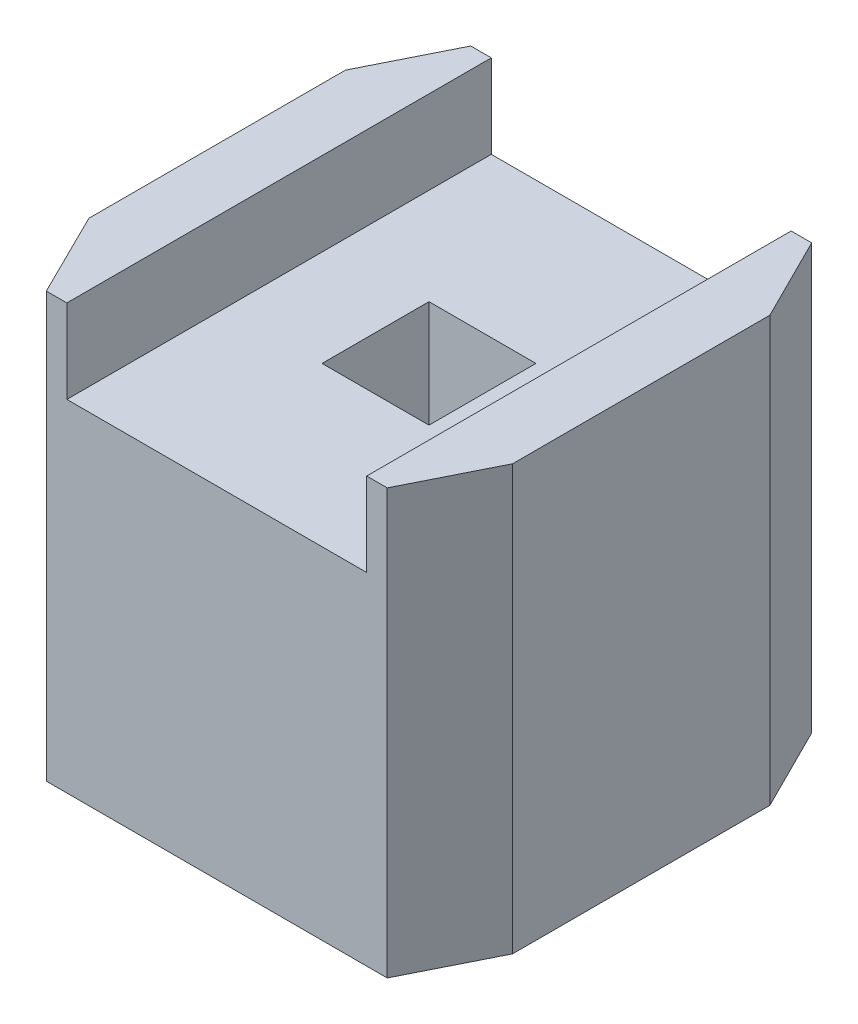
ISO-10303-21;
HEADER;
FILE_DESCRIPTION(('STEP AP214'),'2;1');
FILE_NAME('part.step','',(''),(''),'','','');
FILE_SCHEMA(('AUTOMOTIVE_DESIGN { 1 0 10303 214 1 1 1 1 }'));
ENDSEC;
DATA;
#1=APPLICATION_CONTEXT('core data for automotive mechanical design processes');
#2=APPLICATION_PROTOCOL_DEFINITION('international standard','automotive_design',2000,#1);
#3=PRODUCT_CONTEXT('',#1,'mechanical');
#4=PRODUCT('Part','Part','',(#3));
#5=PRODUCT_RELATED_PRODUCT_CATEGORY('part','',(#4));
#6=PRODUCT_DEFINITION_FORMATION('','',#4);
#7=PRODUCT_DEFINITION_CONTEXT('part definition',#1,'design');
#8=PRODUCT_DEFINITION('design','',#6,#7);
#9=PRODUCT_DEFINITION_SHAPE('','',#8);
#10=(LENGTH_UNIT() NAMED_UNIT(*) SI_UNIT(.MILLI.,.METRE.));
#11=(NAMED_UNIT(*) PLANE_ANGLE_UNIT() SI_UNIT($,.RADIAN.));
#12=(NAMED_UNIT(*) SI_UNIT($,.STERADIAN.) SOLID_ANGLE_UNIT());
#13=UNCERTAINTY_MEASURE_WITH_UNIT(LENGTH_MEASURE(1.E-05),#10,'distance_accuracy_value','');
#14=(GEOMETRIC_REPRESENTATION_CONTEXT(3) GLOBAL_UNCERTAINTY_ASSIGNED_CONTEXT((#13)) GLOBAL_UNIT_ASSIGNED_CONTEXT((#10,
#11,#12)) REPRESENTATION_CONTEXT('',''));
#15=CARTESIAN_POINT('',(0.,0.,0.));
#16=DIRECTION('',(0.,0.,1.));
#17=DIRECTION('',(1.,0.,0.));
#18=AXIS2_PLACEMENT_3D('',#15,#16,#17);
#19=CARTESIAN_POINT('',(0.,2.54,0.));
#20=DIRECTION('',(0.,1.,0.));
#21=DIRECTION('',(0.,0.,1.));
#22=AXIS2_PLACEMENT_3D('',#19,#20,#21);
#23=PLANE('',#22);
#24=DIRECTION('',(0.,0.,1.));
#25=VECTOR('',#24,1.);
#26=CARTESIAN_POINT('',(-0.897144765117483,2.54,1.27));
#27=LINE('',#26,#25);
#28=CARTESIAN_POINT('',(-0.897144765117483,2.54,-1.27));
#29=VERTEX_POINT('',#28);
#30=CARTESIAN_POINT('',(-0.897144765117483,2.54,1.27));
#31=VERTEX_POINT('',#30);
#32=EDGE_CURVE('E284',#29,#31,#27,.T.);
#33=ORIENTED_EDGE('',*,*,#32,.F.);
#34=DIRECTION('',(-1.,0.,0.));
#35=VECTOR('',#34,1.);
#36=CARTESIAN_POINT('',(1.02,2.54,-1.27));
#37=LINE('',#36,#35);
#38=CARTESIAN_POINT('',(-1.02,2.54,-1.27));
#39=VERTEX_POINT('',#38);
#40=EDGE_CURVE('E203',#29,#39,#37,.T.);
#41=ORIENTED_EDGE('',*,*,#40,.T.);
#42=DIRECTION('',(-0.447213595499961,0.,0.894427190999915));
#43=VECTOR('',#42,1.);
#44=CARTESIAN_POINT('',(-1.02,2.54,-1.27));
#45=LINE('',#44,#43);
#46=CARTESIAN_POINT('',(-1.27,2.54,-0.770000000000002));
#47=VERTEX_POINT('',#46);
#48=EDGE_CURVE('E202',#39,#47,#45,.T.);
#49=ORIENTED_EDGE('',*,*,#48,.T.);
#50=DIRECTION('',(0.,0.,1.));
#51=VECTOR('',#50,1.);
#52=CARTESIAN_POINT('',(-1.27,2.54,-0.770000000000002));
#53=LINE('',#52,#51);
#54=CARTESIAN_POINT('',(-1.27,2.54,0.765040333073111));
#55=VERTEX_POINT('',#54);
#56=EDGE_CURVE('E205',#47,#55,#53,.T.);
#57=ORIENTED_EDGE('',*,*,#56,.T.);
#58=DIRECTION('',(0.443689249098496,0.,0.896180701775268));
#59=VECTOR('',#58,1.);
#60=CARTESIAN_POINT('',(-1.27,2.54,0.765040333073111));
#61=LINE('',#60,#59);
#62=CARTESIAN_POINT('',(-1.02,2.54,1.27));
#63=VERTEX_POINT('',#62);
#64=EDGE_CURVE('E207',#55,#63,#61,.T.);
#65=ORIENTED_EDGE('',*,*,#64,.T.);
#66=DIRECTION('',(1.,0.,0.));
#67=VECTOR('',#66,1.);
#68=CARTESIAN_POINT('',(-1.02,2.54,1.27));
#69=LINE('',#68,#67);
#70=EDGE_CURVE('E209',#63,#31,#69,.T.);
#71=ORIENTED_EDGE('',*,*,#70,.T.);
#72=EDGE_LOOP('',(#33,#41,#49,#57,#65,#71));
#73=FACE_BOUND('',#72,.T.);
#74=ADVANCED_FACE('F32',(#73),#23,.T.);
#75=CARTESIAN_POINT('',(-0.32,2.54,0.32));
#76=DIRECTION('',(1.,0.,0.));
#77=DIRECTION('',(0.,0.,-1.));
#78=AXIS2_PLACEMENT_3D('',#75,#76,#77);
#79=PLANE('',#78);
#80=DIRECTION('',(0.,-1.,0.));
#81=VECTOR('',#80,1.);
#82=CARTESIAN_POINT('',(-0.32,2.54,-0.32));
#83=LINE('',#82,#81);
#84=CARTESIAN_POINT('',(-0.32,2.04,-0.32));
#85=VERTEX_POINT('',#84);
#86=CARTESIAN_POINT('',(-0.32,0.,-0.32));
#87=VERTEX_POINT('',#86);
#88=EDGE_CURVE('E190',#85,#87,#83,.T.);
#89=ORIENTED_EDGE('',*,*,#88,.F.);
#90=DIRECTION('',(0.,0.,1.));
#91=VECTOR('',#90,1.);
#92=CARTESIAN_POINT('',(-0.32,2.04,0.32));
#93=LINE('',#92,#91);
#94=CARTESIAN_POINT('',(-0.32,2.04,0.32));
#95=VERTEX_POINT('',#94);
#96=EDGE_CURVE('E55',#85,#95,#93,.T.);
#97=ORIENTED_EDGE('',*,*,#96,.T.);
#98=DIRECTION('',(0.,-1.,0.));
#99=VECTOR('',#98,1.);
#100=CARTESIAN_POINT('',(-0.32,2.54,0.32));
#101=LINE('',#100,#99);
#102=CARTESIAN_POINT('',(-0.32,0.,0.32));
#103=VERTEX_POINT('',#102);
#104=EDGE_CURVE('E196',#95,#103,#101,.T.);
#105=ORIENTED_EDGE('',*,*,#104,.T.);
#106=DIRECTION('',(0.,0.,1.));
#107=VECTOR('',#106,1.);
#108=CARTESIAN_POINT('',(-0.32,0.,0.32));
#109=LINE('',#108,#107);
#110=EDGE_CURVE('E178',#87,#103,#109,.T.);
#111=ORIENTED_EDGE('',*,*,#110,.F.);
#112=EDGE_LOOP('',(#89,#97,#105,#111));
#113=FACE_BOUND('',#112,.T.);
#114=ADVANCED_FACE('F317',(#113),#79,.T.);
#115=CARTESIAN_POINT('',(0.32,2.54,0.32));
#116=DIRECTION('',(0.,0.,-1.));
#117=DIRECTION('',(-1.,0.,0.));
#118=AXIS2_PLACEMENT_3D('',#115,#116,#117);
#119=PLANE('',#118);
#120=ORIENTED_EDGE('',*,*,#104,.F.);
#121=DIRECTION('',(1.,0.,0.));
#122=VECTOR('',#121,1.);
#123=CARTESIAN_POINT('',(0.32,2.04,0.32));
#124=LINE('',#123,#122);
#125=CARTESIAN_POINT('',(0.32,2.04,0.32));
#126=VERTEX_POINT('',#125);
#127=EDGE_CURVE('E174',#95,#126,#124,.T.);
#128=ORIENTED_EDGE('',*,*,#127,.T.);
#129=DIRECTION('',(0.,-1.,0.));
#130=VECTOR('',#129,1.);
#131=CARTESIAN_POINT('',(0.32,2.54,0.32));
#132=LINE('',#131,#130);
#133=CARTESIAN_POINT('',(0.32,0.,0.32));
#134=VERTEX_POINT('',#133);
#135=EDGE_CURVE('E194',#126,#134,#132,.T.);
#136=ORIENTED_EDGE('',*,*,#135,.T.);
#137=DIRECTION('',(1.,0.,0.));
#138=VECTOR('',#137,1.);
#139=CARTESIAN_POINT('',(0.32,0.,0.32));
#140=LINE('',#139,#138);
#141=EDGE_CURVE('E181',#103,#134,#140,.T.);
#142=ORIENTED_EDGE('',*,*,#141,.F.);
#143=EDGE_LOOP('',(#120,#128,#136,#142));
#144=FACE_BOUND('',#143,.T.);
#145=ADVANCED_FACE('F322',(#144),#119,.T.);
#146=CARTESIAN_POINT('',(0.32,2.54,0.32));
#147=DIRECTION('',(-1.,0.,0.));
#148=DIRECTION('',(0.,0.,1.));
#149=AXIS2_PLACEMENT_3D('',#146,#147,#148);
#150=PLANE('',#149);
#151=ORIENTED_EDGE('',*,*,#135,.F.);
#152=DIRECTION('',(0.,0.,-1.));
#153=VECTOR('',#152,1.);
#154=CARTESIAN_POINT('',(0.32,2.04,0.32));
#155=LINE('',#154,#153);
#156=CARTESIAN_POINT('',(0.32,2.04,-0.32));
#157=VERTEX_POINT('',#156);
#158=EDGE_CURVE('E171',#126,#157,#155,.T.);
#159=ORIENTED_EDGE('',*,*,#158,.T.);
#160=DIRECTION('',(0.,-1.,0.));
#161=VECTOR('',#160,1.);
#162=CARTESIAN_POINT('',(0.32,2.54,-0.32));
#163=LINE('',#162,#161);
#164=CARTESIAN_POINT('',(0.32,0.,-0.32));
#165=VERTEX_POINT('',#164);
#166=EDGE_CURVE('E192',#157,#165,#163,.T.);
#167=ORIENTED_EDGE('',*,*,#166,.T.);
#168=DIRECTION('',(0.,0.,-1.));
#169=VECTOR('',#168,1.);
#170=CARTESIAN_POINT('',(0.32,0.,0.32));
#171=LINE('',#170,#169);
#172=EDGE_CURVE('E184',#134,#165,#171,.T.);
#173=ORIENTED_EDGE('',*,*,#172,.F.);
#174=EDGE_LOOP('',(#151,#159,#167,#173));
#175=FACE_BOUND('',#174,.T.);
#176=ADVANCED_FACE('F331',(#175),#150,.T.);
#177=CARTESIAN_POINT('',(0.32,2.54,-0.32));
#178=DIRECTION('',(0.,0.,1.));
#179=DIRECTION('',(1.,0.,0.));
#180=AXIS2_PLACEMENT_3D('',#177,#178,#179);
#181=PLANE('',#180);
#182=ORIENTED_EDGE('',*,*,#166,.F.);
#183=DIRECTION('',(-1.,0.,0.));
#184=VECTOR('',#183,1.);
#185=CARTESIAN_POINT('',(0.32,2.04,-0.32));
#186=LINE('',#185,#184);
#187=EDGE_CURVE('E11',#157,#85,#186,.T.);
#188=ORIENTED_EDGE('',*,*,#187,.T.);
#189=ORIENTED_EDGE('',*,*,#88,.T.);
#190=DIRECTION('',(-1.,0.,0.));
#191=VECTOR('',#190,1.);
#192=CARTESIAN_POINT('',(0.32,0.,-0.32));
#193=LINE('',#192,#191);
#194=EDGE_CURVE('E187',#165,#87,#193,.T.);
#195=ORIENTED_EDGE('',*,*,#194,.F.);
#196=EDGE_LOOP('',(#182,#188,#189,#195));
#197=FACE_BOUND('',#196,.T.);
#198=ADVANCED_FACE('F326',(#197),#181,.T.);
#199=DIRECTION('',(0.,0.,-1.));
#200=VECTOR('',#199,1.);
#201=CARTESIAN_POINT('',(0.897144765117484,2.54,1.27));
#202=LINE('',#201,#200);
#203=CARTESIAN_POINT('',(0.897144765117484,2.54,1.27));
#204=VERTEX_POINT('',#203);
#205=CARTESIAN_POINT('',(0.897144765117484,2.54,-1.27));
#206=VERTEX_POINT('',#205);
#207=EDGE_CURVE('E288',#204,#206,#202,.T.);
#208=ORIENTED_EDGE('',*,*,#207,.F.);
#209=CARTESIAN_POINT('',(1.02,2.54,1.27));
#210=VERTEX_POINT('',#209);
#211=EDGE_CURVE('E163',#204,#210,#69,.T.);
#212=ORIENTED_EDGE('',*,*,#211,.T.);
#213=DIRECTION('',(0.44721359549996,0.,-0.894427190999915));
#214=VECTOR('',#213,1.);
#215=CARTESIAN_POINT('',(1.02,2.54,1.27));
#216=LINE('',#215,#214);
#217=CARTESIAN_POINT('',(1.27,2.54,0.770000000000001));
#218=VERTEX_POINT('',#217);
#219=EDGE_CURVE('E212',#210,#218,#216,.T.);
#220=ORIENTED_EDGE('',*,*,#219,.T.);
#221=DIRECTION('',(0.,0.,-1.));
#222=VECTOR('',#221,1.);
#223=CARTESIAN_POINT('',(1.27,2.54,0.770000000000001));
#224=LINE('',#223,#222);
#225=CARTESIAN_POINT('',(1.27,2.54,-0.769999999999998));
#226=VERTEX_POINT('',#225);
#227=EDGE_CURVE('E214',#218,#226,#224,.T.);
#228=ORIENTED_EDGE('',*,*,#227,.T.);
#229=DIRECTION('',(-0.447213595499957,0.,-0.894427190999917));
#230=VECTOR('',#229,1.);
#231=CARTESIAN_POINT('',(1.27,2.54,-0.769999999999998));
#232=LINE('',#231,#230);
#233=CARTESIAN_POINT('',(1.02,2.54,-1.27));
#234=VERTEX_POINT('',#233);
#235=EDGE_CURVE('E216',#226,#234,#232,.T.);
#236=ORIENTED_EDGE('',*,*,#235,.T.);
#237=EDGE_CURVE('E199',#234,#206,#37,.T.);
#238=ORIENTED_EDGE('',*,*,#237,.T.);
#239=EDGE_LOOP('',(#208,#212,#220,#228,#236,#238));
#240=FACE_BOUND('',#239,.T.);
#241=ADVANCED_FACE('F304',(#240),#23,.T.);
#242=CARTESIAN_POINT('',(0.,0.,0.));
#243=DIRECTION('',(0.,1.,0.));
#244=DIRECTION('',(0.,0.,1.));
#245=AXIS2_PLACEMENT_3D('',#242,#243,#244);
#246=PLANE('',#245);
#247=DIRECTION('',(-1.,0.,0.));
#248=VECTOR('',#247,1.);
#249=CARTESIAN_POINT('',(1.02,0.,-1.27));
#250=LINE('',#249,#248);
#251=CARTESIAN_POINT('',(1.02,0.,-1.27));
#252=VERTEX_POINT('',#251);
#253=CARTESIAN_POINT('',(-1.02,0.,-1.27));
#254=VERTEX_POINT('',#253);
#255=EDGE_CURVE('E198',#252,#254,#250,.T.);
#256=ORIENTED_EDGE('',*,*,#255,.F.);
#257=DIRECTION('',(-0.447213595499957,0.,-0.894427190999917));
#258=VECTOR('',#257,1.);
#259=CARTESIAN_POINT('',(1.27,0.,-0.769999999999998));
#260=LINE('',#259,#258);
#261=CARTESIAN_POINT('',(1.27,0.,-0.769999999999998));
#262=VERTEX_POINT('',#261);
#263=EDGE_CURVE('E233',#262,#252,#260,.T.);
#264=ORIENTED_EDGE('',*,*,#263,.F.);
#265=DIRECTION('',(0.,0.,-1.));
#266=VECTOR('',#265,1.);
#267=CARTESIAN_POINT('',(1.27,0.,0.770000000000001));
#268=LINE('',#267,#266);
#269=CARTESIAN_POINT('',(1.27,0.,0.770000000000001));
#270=VERTEX_POINT('',#269);
#271=EDGE_CURVE('E231',#270,#262,#268,.T.);
#272=ORIENTED_EDGE('',*,*,#271,.F.);
#273=DIRECTION('',(0.44721359549996,0.,-0.894427190999915));
#274=VECTOR('',#273,1.);
#275=CARTESIAN_POINT('',(1.02,0.,1.27));
#276=LINE('',#275,#274);
#277=CARTESIAN_POINT('',(1.02,0.,1.27));
#278=VERTEX_POINT('',#277);
#279=EDGE_CURVE('E229',#278,#270,#276,.T.);
#280=ORIENTED_EDGE('',*,*,#279,.F.);
#281=DIRECTION('',(1.,0.,0.));
#282=VECTOR('',#281,1.);
#283=CARTESIAN_POINT('',(-1.02,0.,1.27));
#284=LINE('',#283,#282);
#285=CARTESIAN_POINT('',(-1.02,0.,1.27));
#286=VERTEX_POINT('',#285);
#287=EDGE_CURVE('E227',#286,#278,#284,.T.);
#288=ORIENTED_EDGE('',*,*,#287,.F.);
#289=DIRECTION('',(0.443689249098496,0.,0.896180701775268));
#290=VECTOR('',#289,1.);
#291=CARTESIAN_POINT('',(-1.27,0.,0.765040333073111));
#292=LINE('',#291,#290);
#293=CARTESIAN_POINT('',(-1.27,0.,0.765040333073111));
#294=VERTEX_POINT('',#293);
#295=EDGE_CURVE('E225',#294,#286,#292,.T.);
#296=ORIENTED_EDGE('',*,*,#295,.F.);
#297=DIRECTION('',(0.,0.,1.));
#298=VECTOR('',#297,1.);
#299=CARTESIAN_POINT('',(-1.27,0.,-0.770000000000002));
#300=LINE('',#299,#298);
#301=CARTESIAN_POINT('',(-1.27,0.,-0.770000000000002));
#302=VERTEX_POINT('',#301);
#303=EDGE_CURVE('E223',#302,#294,#300,.T.);
#304=ORIENTED_EDGE('',*,*,#303,.F.);
#305=DIRECTION('',(-0.447213595499961,0.,0.894427190999915));
#306=VECTOR('',#305,1.);
#307=CARTESIAN_POINT('',(-1.02,0.,-1.27));
#308=LINE('',#307,#306);
#309=EDGE_CURVE('E221',#254,#302,#308,.T.);
#310=ORIENTED_EDGE('',*,*,#309,.F.);
#311=EDGE_LOOP('',(#256,#264,#272,#280,#288,#296,#304,#310));
#312=FACE_BOUND('',#311,.T.);
#313=ORIENTED_EDGE('',*,*,#110,.T.);
#314=ORIENTED_EDGE('',*,*,#141,.T.);
#315=ORIENTED_EDGE('',*,*,#172,.T.);
#316=ORIENTED_EDGE('',*,*,#194,.T.);
#317=EDGE_LOOP('',(#313,#314,#315,#316));
#318=FACE_BOUND('',#317,.T.);
#319=ADVANCED_FACE('F267',(#312,#318),#246,.F.);
#320=CARTESIAN_POINT('',(1.02,2.54,-1.27));
#321=DIRECTION('',(0.,0.,1.));
#322=DIRECTION('',(1.,0.,0.));
#323=AXIS2_PLACEMENT_3D('',#320,#321,#322);
#324=PLANE('',#323);
#325=ORIENTED_EDGE('',*,*,#40,.F.);
#326=DIRECTION('',(0.,1.,0.));
#327=VECTOR('',#326,1.);
#328=CARTESIAN_POINT('',(-0.897144765117483,2.04,-1.27));
#329=LINE('',#328,#327);
#330=CARTESIAN_POINT('',(-0.897144765117483,2.04,-1.27));
#331=VERTEX_POINT('',#330);
#332=EDGE_CURVE('E166',#331,#29,#329,.T.);
#333=ORIENTED_EDGE('',*,*,#332,.F.);
#334=DIRECTION('',(-1.,0.,0.));
#335=VECTOR('',#334,1.);
#336=CARTESIAN_POINT('',(0.897144765117484,2.04,-1.27));
#337=LINE('',#336,#335);
#338=CARTESIAN_POINT('',(0.897144765117484,2.04,-1.27));
#339=VERTEX_POINT('',#338);
#340=EDGE_CURVE('E152',#339,#331,#337,.T.);
#341=ORIENTED_EDGE('',*,*,#340,.F.);
#342=DIRECTION('',(0.,1.,0.));
#343=VECTOR('',#342,1.);
#344=CARTESIAN_POINT('',(0.897144765117484,2.04,-1.27));
#345=LINE('',#344,#343);
#346=EDGE_CURVE('E150',#339,#206,#345,.T.);
#347=ORIENTED_EDGE('',*,*,#346,.T.);
#348=ORIENTED_EDGE('',*,*,#237,.F.);
#349=DIRECTION('',(0.,-1.,0.));
#350=VECTOR('',#349,1.);
#351=CARTESIAN_POINT('',(1.02,2.54,-1.27));
#352=LINE('',#351,#350);
#353=EDGE_CURVE('E218',#234,#252,#352,.T.);
#354=ORIENTED_EDGE('',*,*,#353,.T.);
#355=ORIENTED_EDGE('',*,*,#255,.T.);
#356=DIRECTION('',(0.,-1.,0.));
#357=VECTOR('',#356,1.);
#358=CARTESIAN_POINT('',(-1.02,2.54,-1.27));
#359=LINE('',#358,#357);
#360=EDGE_CURVE('E40',#39,#254,#359,.T.);
#361=ORIENTED_EDGE('',*,*,#360,.F.);
#362=EDGE_LOOP('',(#325,#333,#341,#347,#348,#354,#355,#361));
#363=FACE_BOUND('',#362,.T.);
#364=ADVANCED_FACE('F34',(#363),#324,.F.);
#365=CARTESIAN_POINT('',(-1.02,2.54,-1.27));
#366=DIRECTION('',(0.894427190999915,0.,0.44721359549996));
#367=DIRECTION('',(0.447213595499961,0.,-0.894427190999915));
#368=AXIS2_PLACEMENT_3D('',#365,#366,#367);
#369=PLANE('',#368);
#370=ORIENTED_EDGE('',*,*,#309,.T.);
#371=DIRECTION('',(0.,-1.,0.));
#372=VECTOR('',#371,1.);
#373=CARTESIAN_POINT('',(-1.27,2.54,-0.770000000000002));
#374=LINE('',#373,#372);
#375=EDGE_CURVE('E252',#47,#302,#374,.T.);
#376=ORIENTED_EDGE('',*,*,#375,.F.);
#377=ORIENTED_EDGE('',*,*,#48,.F.);
#378=ORIENTED_EDGE('',*,*,#360,.T.);
#379=EDGE_LOOP('',(#370,#376,#377,#378));
#380=FACE_BOUND('',#379,.T.);
#381=ADVANCED_FACE('F258',(#380),#369,.F.);
#382=CARTESIAN_POINT('',(-1.27,2.54,-0.770000000000002));
#383=DIRECTION('',(1.,0.,0.));
#384=DIRECTION('',(0.,0.,-1.));
#385=AXIS2_PLACEMENT_3D('',#382,#383,#384);
#386=PLANE('',#385);
#387=ORIENTED_EDGE('',*,*,#303,.T.);
#388=DIRECTION('',(0.,-1.,0.));
#389=VECTOR('',#388,1.);
#390=CARTESIAN_POINT('',(-1.27,2.54,0.765040333073111));
#391=LINE('',#390,#389);
#392=EDGE_CURVE('E249',#55,#294,#391,.T.);
#393=ORIENTED_EDGE('',*,*,#392,.F.);
#394=ORIENTED_EDGE('',*,*,#56,.F.);
#395=ORIENTED_EDGE('',*,*,#375,.T.);
#396=EDGE_LOOP('',(#387,#393,#394,#395));
#397=FACE_BOUND('',#396,.T.);
#398=ADVANCED_FACE('F275',(#397),#386,.F.);
#399=CARTESIAN_POINT('',(-1.27,2.54,0.765040333073111));
#400=DIRECTION('',(0.896180701775268,0.,-0.443689249098496));
#401=DIRECTION('',(-0.443689249098497,0.,-0.896180701775268));
#402=AXIS2_PLACEMENT_3D('',#399,#400,#401);
#403=PLANE('',#402);
#404=ORIENTED_EDGE('',*,*,#295,.T.);
#405=DIRECTION('',(0.,-1.,0.));
#406=VECTOR('',#405,1.);
#407=CARTESIAN_POINT('',(-1.02,2.54,1.27));
#408=LINE('',#407,#406);
#409=EDGE_CURVE('E246',#63,#286,#408,.T.);
#410=ORIENTED_EDGE('',*,*,#409,.F.);
#411=ORIENTED_EDGE('',*,*,#64,.F.);
#412=ORIENTED_EDGE('',*,*,#392,.T.);
#413=EDGE_LOOP('',(#404,#410,#411,#412));
#414=FACE_BOUND('',#413,.T.);
#415=ADVANCED_FACE('F279',(#414),#403,.F.);
#416=CARTESIAN_POINT('',(-1.02,2.54,1.27));
#417=DIRECTION('',(0.,0.,-1.));
#418=DIRECTION('',(-1.,0.,0.));
#419=AXIS2_PLACEMENT_3D('',#416,#417,#418);
#420=PLANE('',#419);
#421=DIRECTION('',(1.,0.,0.));
#422=VECTOR('',#421,1.);
#423=CARTESIAN_POINT('',(0.897144765117484,2.04,1.27));
#424=LINE('',#423,#422);
#425=CARTESIAN_POINT('',(-0.897144765117483,2.04,1.27));
#426=VERTEX_POINT('',#425);
#427=CARTESIAN_POINT('',(0.897144765117484,2.04,1.27));
#428=VERTEX_POINT('',#427);
#429=EDGE_CURVE('E153',#426,#428,#424,.T.);
#430=ORIENTED_EDGE('',*,*,#429,.F.);
#431=DIRECTION('',(0.,1.,0.));
#432=VECTOR('',#431,1.);
#433=CARTESIAN_POINT('',(-0.897144765117483,2.04,1.27));
#434=LINE('',#433,#432);
#435=EDGE_CURVE('E164',#426,#31,#434,.T.);
#436=ORIENTED_EDGE('',*,*,#435,.T.);
#437=ORIENTED_EDGE('',*,*,#70,.F.);
#438=ORIENTED_EDGE('',*,*,#409,.T.);
#439=ORIENTED_EDGE('',*,*,#287,.T.);
#440=DIRECTION('',(0.,-1.,0.));
#441=VECTOR('',#440,1.);
#442=CARTESIAN_POINT('',(1.02,2.54,1.27));
#443=LINE('',#442,#441);
#444=EDGE_CURVE('E243',#210,#278,#443,.T.);
#445=ORIENTED_EDGE('',*,*,#444,.F.);
#446=ORIENTED_EDGE('',*,*,#211,.F.);
#447=DIRECTION('',(0.,1.,0.));
#448=VECTOR('',#447,1.);
#449=CARTESIAN_POINT('',(0.897144765117484,2.04,1.27));
#450=LINE('',#449,#448);
#451=EDGE_CURVE('E147',#428,#204,#450,.T.);
#452=ORIENTED_EDGE('',*,*,#451,.F.);
#453=EDGE_LOOP('',(#430,#436,#437,#438,#439,#445,#446,#452));
#454=FACE_BOUND('',#453,.T.);
#455=ADVANCED_FACE('F161',(#454),#420,.F.);
#456=CARTESIAN_POINT('',(1.02,2.54,1.27));
#457=DIRECTION('',(-0.894427190999915,0.,-0.44721359549996));
#458=DIRECTION('',(-0.44721359549996,0.,0.894427190999915));
#459=AXIS2_PLACEMENT_3D('',#456,#457,#458);
#460=PLANE('',#459);
#461=ORIENTED_EDGE('',*,*,#279,.T.);
#462=DIRECTION('',(0.,-1.,0.));
#463=VECTOR('',#462,1.);
#464=CARTESIAN_POINT('',(1.27,2.54,0.770000000000001));
#465=LINE('',#464,#463);
#466=EDGE_CURVE('E240',#218,#270,#465,.T.);
#467=ORIENTED_EDGE('',*,*,#466,.F.);
#468=ORIENTED_EDGE('',*,*,#219,.F.);
#469=ORIENTED_EDGE('',*,*,#444,.T.);
#470=EDGE_LOOP('',(#461,#467,#468,#469));
#471=FACE_BOUND('',#470,.T.);
#472=ADVANCED_FACE('F296',(#471),#460,.F.);
#473=CARTESIAN_POINT('',(1.27,2.54,0.770000000000001));
#474=DIRECTION('',(-1.,0.,0.));
#475=DIRECTION('',(0.,0.,1.));
#476=AXIS2_PLACEMENT_3D('',#473,#474,#475);
#477=PLANE('',#476);
#478=ORIENTED_EDGE('',*,*,#271,.T.);
#479=DIRECTION('',(0.,-1.,0.));
#480=VECTOR('',#479,1.);
#481=CARTESIAN_POINT('',(1.27,2.54,-0.769999999999998));
#482=LINE('',#481,#480);
#483=EDGE_CURVE('E237',#226,#262,#482,.T.);
#484=ORIENTED_EDGE('',*,*,#483,.F.);
#485=ORIENTED_EDGE('',*,*,#227,.F.);
#486=ORIENTED_EDGE('',*,*,#466,.T.);
#487=EDGE_LOOP('',(#478,#484,#485,#486));
#488=FACE_BOUND('',#487,.T.);
#489=ADVANCED_FACE('F300',(#488),#477,.F.);
#490=CARTESIAN_POINT('',(1.27,2.54,-0.769999999999998));
#491=DIRECTION('',(-0.894427190999917,0.,0.447213595499957));
#492=DIRECTION('',(0.447213595499957,0.,0.894427190999917));
#493=AXIS2_PLACEMENT_3D('',#490,#491,#492);
#494=PLANE('',#493);
#495=ORIENTED_EDGE('',*,*,#263,.T.);
#496=ORIENTED_EDGE('',*,*,#353,.F.);
#497=ORIENTED_EDGE('',*,*,#235,.F.);
#498=ORIENTED_EDGE('',*,*,#483,.T.);
#499=EDGE_LOOP('',(#495,#496,#497,#498));
#500=FACE_BOUND('',#499,.T.);
#501=ADVANCED_FACE('F306',(#500),#494,.F.);
#502=CARTESIAN_POINT('',(-0.897144765117483,2.04,1.27));
#503=DIRECTION('',(-1.,0.,0.));
#504=DIRECTION('',(0.,0.,1.));
#505=AXIS2_PLACEMENT_3D('',#502,#503,#504);
#506=PLANE('',#505);
#507=ORIENTED_EDGE('',*,*,#32,.T.);
#508=ORIENTED_EDGE('',*,*,#435,.F.);
#509=DIRECTION('',(0.,0.,1.));
#510=VECTOR('',#509,1.);
#511=CARTESIAN_POINT('',(-0.897144765117483,2.04,1.27));
#512=LINE('',#511,#510);
#513=EDGE_CURVE('E47',#331,#426,#512,.T.);
#514=ORIENTED_EDGE('',*,*,#513,.F.);
#515=ORIENTED_EDGE('',*,*,#332,.T.);
#516=EDGE_LOOP('',(#507,#508,#514,#515));
#517=FACE_BOUND('',#516,.T.);
#518=ADVANCED_FACE('F292',(#517),#506,.F.);
#519=CARTESIAN_POINT('',(0.897144765117484,2.04,1.27));
#520=DIRECTION('',(1.,0.,0.));
#521=DIRECTION('',(0.,0.,-1.));
#522=AXIS2_PLACEMENT_3D('',#519,#520,#521);
#523=PLANE('',#522);
#524=ORIENTED_EDGE('',*,*,#207,.T.);
#525=ORIENTED_EDGE('',*,*,#346,.F.);
#526=DIRECTION('',(0.,0.,-1.));
#527=VECTOR('',#526,1.);
#528=CARTESIAN_POINT('',(0.897144765117484,2.04,1.27));
#529=LINE('',#528,#527);
#530=EDGE_CURVE('E144',#428,#339,#529,.T.);
#531=ORIENTED_EDGE('',*,*,#530,.F.);
#532=ORIENTED_EDGE('',*,*,#451,.T.);
#533=EDGE_LOOP('',(#524,#525,#531,#532));
#534=FACE_BOUND('',#533,.T.);
#535=ADVANCED_FACE('F145',(#534),#523,.F.);
#536=CARTESIAN_POINT('',(0.,2.04,0.));
#537=DIRECTION('',(0.,1.,0.));
#538=DIRECTION('',(0.,0.,1.));
#539=AXIS2_PLACEMENT_3D('',#536,#537,#538);
#540=PLANE('',#539);
#541=ORIENTED_EDGE('',*,*,#187,.F.);
#542=ORIENTED_EDGE('',*,*,#158,.F.);
#543=ORIENTED_EDGE('',*,*,#127,.F.);
#544=ORIENTED_EDGE('',*,*,#96,.F.);
#545=EDGE_LOOP('',(#541,#542,#543,#544));
#546=FACE_BOUND('',#545,.T.);
#547=ORIENTED_EDGE('',*,*,#513,.T.);
#548=ORIENTED_EDGE('',*,*,#429,.T.);
#549=ORIENTED_EDGE('',*,*,#530,.T.);
#550=ORIENTED_EDGE('',*,*,#340,.T.);
#551=EDGE_LOOP('',(#547,#548,#549,#550));
#552=FACE_BOUND('',#551,.T.);
#553=ADVANCED_FACE('F156',(#546,#552),#540,.T.);
#554=CLOSED_SHELL('',(#74,#114,#145,#176,#198,#241,#319,#364,#381,#398,#415,#455,#472,#489,#501,
#518,#535,#553));
#555=MANIFOLD_SOLID_BREP('B2',#554);
#556=ADVANCED_BREP_SHAPE_REPRESENTATION('',(#18,#555),#14);
#557=SHAPE_DEFINITION_REPRESENTATION(#9,#556);
ENDSEC;
END-ISO-10303-21;
